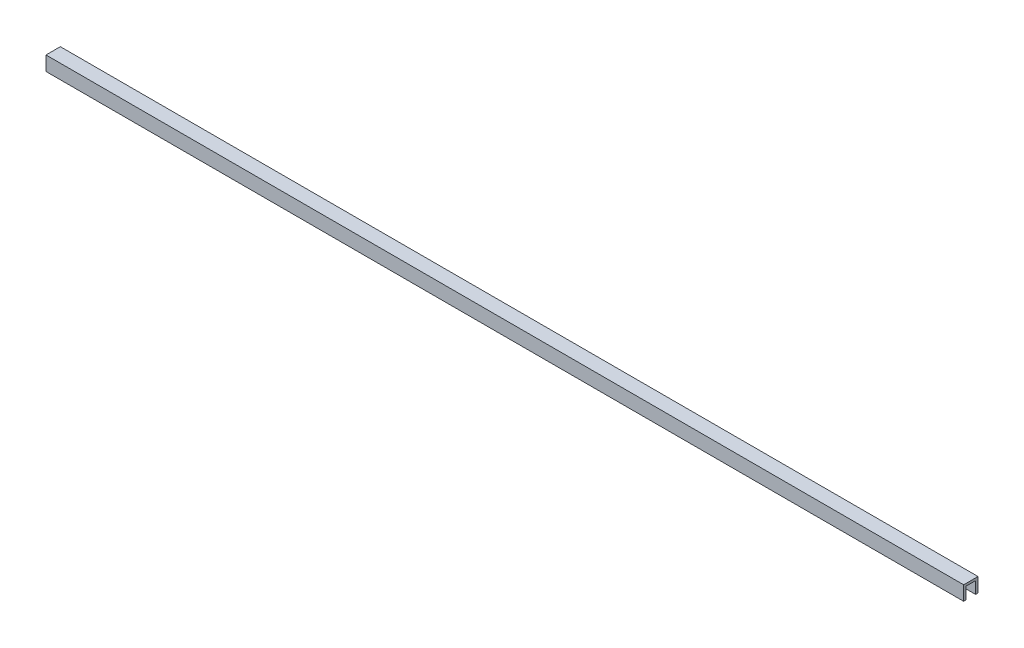
ISO-10303-21;
HEADER;
FILE_DESCRIPTION(('STEP AP214'),'2;1');
FILE_NAME('part.step','',(''),(''),'','','');
FILE_SCHEMA(('AUTOMOTIVE_DESIGN { 1 0 10303 214 1 1 1 1 }'));
ENDSEC;
DATA;
#1=APPLICATION_CONTEXT('core data for automotive mechanical design processes');
#2=APPLICATION_PROTOCOL_DEFINITION('international standard','automotive_design',2000,#1);
#3=PRODUCT_CONTEXT('',#1,'mechanical');
#4=PRODUCT('Part','Part','',(#3));
#5=PRODUCT_RELATED_PRODUCT_CATEGORY('part','',(#4));
#6=PRODUCT_DEFINITION_FORMATION('','',#4);
#7=PRODUCT_DEFINITION_CONTEXT('part definition',#1,'design');
#8=PRODUCT_DEFINITION('design','',#6,#7);
#9=PRODUCT_DEFINITION_SHAPE('','',#8);
#10=(LENGTH_UNIT() NAMED_UNIT(*) SI_UNIT(.MILLI.,.METRE.));
#11=(NAMED_UNIT(*) PLANE_ANGLE_UNIT() SI_UNIT($,.RADIAN.));
#12=(NAMED_UNIT(*) SI_UNIT($,.STERADIAN.) SOLID_ANGLE_UNIT());
#13=UNCERTAINTY_MEASURE_WITH_UNIT(LENGTH_MEASURE(1.E-05),#10,'distance_accuracy_value','');
#14=(GEOMETRIC_REPRESENTATION_CONTEXT(3) GLOBAL_UNCERTAINTY_ASSIGNED_CONTEXT((#13)) GLOBAL_UNIT_ASSIGNED_CONTEXT((#10,
#11,#12)) REPRESENTATION_CONTEXT('',''));
#15=CARTESIAN_POINT('',(0.,0.,0.));
#16=DIRECTION('',(0.,0.,1.));
#17=DIRECTION('',(1.,0.,0.));
#18=AXIS2_PLACEMENT_3D('',#15,#16,#17);
#19=CARTESIAN_POINT('',(-609.6,-9.525,6.35));
#20=DIRECTION('',(0.,0.,-1.));
#21=DIRECTION('',(-1.,0.,0.));
#22=AXIS2_PLACEMENT_3D('',#19,#20,#21);
#23=PLANE('',#22);
#24=DIRECTION('',(1.,0.,0.));
#25=VECTOR('',#24,1.);
#26=CARTESIAN_POINT('',(-609.6,-9.525,6.35));
#27=LINE('',#26,#25);
#28=CARTESIAN_POINT('',(-609.6,-9.525,6.35));
#29=VERTEX_POINT('',#28);
#30=CARTESIAN_POINT('',(609.6,-9.525,6.35));
#31=VERTEX_POINT('',#30);
#32=EDGE_CURVE('E84',#29,#31,#27,.T.);
#33=ORIENTED_EDGE('',*,*,#32,.F.);
#34=DIRECTION('',(0.,1.,0.));
#35=VECTOR('',#34,1.);
#36=CARTESIAN_POINT('',(-609.6,0.,6.35));
#37=LINE('',#36,#35);
#38=CARTESIAN_POINT('',(-609.6,6.35,6.35));
#39=VERTEX_POINT('',#38);
#40=EDGE_CURVE('E123',#29,#39,#37,.T.);
#41=ORIENTED_EDGE('',*,*,#40,.T.);
#42=DIRECTION('',(1.,0.,0.));
#43=VECTOR('',#42,1.);
#44=CARTESIAN_POINT('',(-609.6,6.35,6.35));
#45=LINE('',#44,#43);
#46=CARTESIAN_POINT('',(609.6,6.35,6.35));
#47=VERTEX_POINT('',#46);
#48=EDGE_CURVE('E20',#47,#39,#45,.F.);
#49=ORIENTED_EDGE('',*,*,#48,.F.);
#50=DIRECTION('',(0.,1.,0.));
#51=VECTOR('',#50,1.);
#52=CARTESIAN_POINT('',(609.6,0.,6.35));
#53=LINE('',#52,#51);
#54=EDGE_CURVE('E95',#31,#47,#53,.T.);
#55=ORIENTED_EDGE('',*,*,#54,.F.);
#56=EDGE_LOOP('',(#33,#41,#49,#55));
#57=FACE_BOUND('',#56,.T.);
#58=ADVANCED_FACE('F17',(#57),#23,.T.);
#59=CARTESIAN_POINT('',(-609.6,6.35,6.35));
#60=DIRECTION('',(0.,-1.,0.));
#61=DIRECTION('',(0.,0.,-1.));
#62=AXIS2_PLACEMENT_3D('',#59,#60,#61);
#63=PLANE('',#62);
#64=ORIENTED_EDGE('',*,*,#48,.T.);
#65=DIRECTION('',(0.,0.,-1.));
#66=VECTOR('',#65,1.);
#67=CARTESIAN_POINT('',(-609.6,6.35,0.));
#68=LINE('',#67,#66);
#69=CARTESIAN_POINT('',(-609.6,6.35,-6.35));
#70=VERTEX_POINT('',#69);
#71=EDGE_CURVE('E119',#39,#70,#68,.T.);
#72=ORIENTED_EDGE('',*,*,#71,.T.);
#73=DIRECTION('',(1.,0.,0.));
#74=VECTOR('',#73,1.);
#75=CARTESIAN_POINT('',(-609.6,6.35,-6.35));
#76=LINE('',#75,#74);
#77=CARTESIAN_POINT('',(609.6,6.35,-6.35));
#78=VERTEX_POINT('',#77);
#79=EDGE_CURVE('E111',#78,#70,#76,.F.);
#80=ORIENTED_EDGE('',*,*,#79,.F.);
#81=DIRECTION('',(0.,0.,-1.));
#82=VECTOR('',#81,1.);
#83=CARTESIAN_POINT('',(609.6,6.35,0.));
#84=LINE('',#83,#82);
#85=EDGE_CURVE('E98',#47,#78,#84,.T.);
#86=ORIENTED_EDGE('',*,*,#85,.F.);
#87=EDGE_LOOP('',(#64,#72,#80,#86));
#88=FACE_BOUND('',#87,.T.);
#89=ADVANCED_FACE('F118',(#88),#63,.T.);
#90=CARTESIAN_POINT('',(-609.6,6.35,-6.35));
#91=DIRECTION('',(0.,0.,1.));
#92=DIRECTION('',(1.,0.,0.));
#93=AXIS2_PLACEMENT_3D('',#90,#91,#92);
#94=PLANE('',#93);
#95=ORIENTED_EDGE('',*,*,#79,.T.);
#96=DIRECTION('',(0.,1.,0.));
#97=VECTOR('',#96,1.);
#98=CARTESIAN_POINT('',(-609.6,0.,-6.35));
#99=LINE('',#98,#97);
#100=CARTESIAN_POINT('',(-609.6,-9.525,-6.35));
#101=VERTEX_POINT('',#100);
#102=EDGE_CURVE('E125',#70,#101,#99,.F.);
#103=ORIENTED_EDGE('',*,*,#102,.T.);
#104=DIRECTION('',(1.,0.,0.));
#105=VECTOR('',#104,1.);
#106=CARTESIAN_POINT('',(-609.6,-9.525,-6.35));
#107=LINE('',#106,#105);
#108=CARTESIAN_POINT('',(609.6,-9.525,-6.35));
#109=VERTEX_POINT('',#108);
#110=EDGE_CURVE('E109',#109,#101,#107,.F.);
#111=ORIENTED_EDGE('',*,*,#110,.F.);
#112=DIRECTION('',(0.,1.,0.));
#113=VECTOR('',#112,1.);
#114=CARTESIAN_POINT('',(609.6,0.,-6.35));
#115=LINE('',#114,#113);
#116=EDGE_CURVE('E143',#78,#109,#115,.F.);
#117=ORIENTED_EDGE('',*,*,#116,.F.);
#118=EDGE_LOOP('',(#95,#103,#111,#117));
#119=FACE_BOUND('',#118,.T.);
#120=ADVANCED_FACE('F146',(#119),#94,.T.);
#121=CARTESIAN_POINT('',(-609.6,-9.525,-6.35));
#122=DIRECTION('',(0.,-1.,0.));
#123=DIRECTION('',(0.,0.,-1.));
#124=AXIS2_PLACEMENT_3D('',#121,#122,#123);
#125=PLANE('',#124);
#126=ORIENTED_EDGE('',*,*,#110,.T.);
#127=DIRECTION('',(0.,0.,-1.));
#128=VECTOR('',#127,1.);
#129=CARTESIAN_POINT('',(-609.6,-9.525,0.));
#130=LINE('',#129,#128);
#131=CARTESIAN_POINT('',(-609.6,-9.525,-9.525));
#132=VERTEX_POINT('',#131);
#133=EDGE_CURVE('E127',#101,#132,#130,.T.);
#134=ORIENTED_EDGE('',*,*,#133,.T.);
#135=DIRECTION('',(-1.,0.,0.));
#136=VECTOR('',#135,1.);
#137=CARTESIAN_POINT('',(-609.6,-9.525,-9.525));
#138=LINE('',#137,#136);
#139=CARTESIAN_POINT('',(609.6,-9.525,-9.525));
#140=VERTEX_POINT('',#139);
#141=EDGE_CURVE('E92',#140,#132,#138,.T.);
#142=ORIENTED_EDGE('',*,*,#141,.F.);
#143=DIRECTION('',(0.,0.,-1.));
#144=VECTOR('',#143,1.);
#145=CARTESIAN_POINT('',(609.6,-9.525,0.));
#146=LINE('',#145,#144);
#147=EDGE_CURVE('E140',#109,#140,#146,.T.);
#148=ORIENTED_EDGE('',*,*,#147,.F.);
#149=EDGE_LOOP('',(#126,#134,#142,#148));
#150=FACE_BOUND('',#149,.T.);
#151=ADVANCED_FACE('F148',(#150),#125,.T.);
#152=CARTESIAN_POINT('',(-609.6,-9.525,-9.525));
#153=DIRECTION('',(0.,0.,-1.));
#154=DIRECTION('',(-1.,0.,0.));
#155=AXIS2_PLACEMENT_3D('',#152,#153,#154);
#156=PLANE('',#155);
#157=ORIENTED_EDGE('',*,*,#141,.T.);
#158=DIRECTION('',(0.,1.,0.));
#159=VECTOR('',#158,1.);
#160=CARTESIAN_POINT('',(-609.6,0.,-9.525));
#161=LINE('',#160,#159);
#162=CARTESIAN_POINT('',(-609.6,9.525,-9.525));
#163=VERTEX_POINT('',#162);
#164=EDGE_CURVE('E163',#132,#163,#161,.T.);
#165=ORIENTED_EDGE('',*,*,#164,.T.);
#166=DIRECTION('',(1.,0.,0.));
#167=VECTOR('',#166,1.);
#168=CARTESIAN_POINT('',(-609.6,9.525,-9.525));
#169=LINE('',#168,#167);
#170=CARTESIAN_POINT('',(609.6,9.525,-9.525));
#171=VERTEX_POINT('',#170);
#172=EDGE_CURVE('E133',#171,#163,#169,.F.);
#173=ORIENTED_EDGE('',*,*,#172,.F.);
#174=DIRECTION('',(0.,1.,0.));
#175=VECTOR('',#174,1.);
#176=CARTESIAN_POINT('',(609.6,0.,-9.525));
#177=LINE('',#176,#175);
#178=EDGE_CURVE('E138',#140,#171,#177,.T.);
#179=ORIENTED_EDGE('',*,*,#178,.F.);
#180=EDGE_LOOP('',(#157,#165,#173,#179));
#181=FACE_BOUND('',#180,.T.);
#182=ADVANCED_FACE('F152',(#181),#156,.T.);
#183=CARTESIAN_POINT('',(-609.6,-9.525,9.525));
#184=DIRECTION('',(0.,-1.,0.));
#185=DIRECTION('',(0.,0.,-1.));
#186=AXIS2_PLACEMENT_3D('',#183,#184,#185);
#187=PLANE('',#186);
#188=DIRECTION('',(1.,0.,0.));
#189=VECTOR('',#188,1.);
#190=CARTESIAN_POINT('',(-609.6,-9.525,9.525));
#191=LINE('',#190,#189);
#192=CARTESIAN_POINT('',(-609.6,-9.525,9.525));
#193=VERTEX_POINT('',#192);
#194=CARTESIAN_POINT('',(609.6,-9.525,9.525));
#195=VERTEX_POINT('',#194);
#196=EDGE_CURVE('E158',#193,#195,#191,.T.);
#197=ORIENTED_EDGE('',*,*,#196,.F.);
#198=DIRECTION('',(0.,0.,-1.));
#199=VECTOR('',#198,1.);
#200=CARTESIAN_POINT('',(-609.6,-9.525,0.));
#201=LINE('',#200,#199);
#202=EDGE_CURVE('E90',#193,#29,#201,.T.);
#203=ORIENTED_EDGE('',*,*,#202,.T.);
#204=ORIENTED_EDGE('',*,*,#32,.T.);
#205=DIRECTION('',(0.,0.,-1.));
#206=VECTOR('',#205,1.);
#207=CARTESIAN_POINT('',(609.6,-9.525,0.));
#208=LINE('',#207,#206);
#209=EDGE_CURVE('E87',#195,#31,#208,.T.);
#210=ORIENTED_EDGE('',*,*,#209,.F.);
#211=EDGE_LOOP('',(#197,#203,#204,#210));
#212=FACE_BOUND('',#211,.T.);
#213=ADVANCED_FACE('F85',(#212),#187,.T.);
#214=CARTESIAN_POINT('',(609.6,0.,0.));
#215=DIRECTION('',(1.,0.,0.));
#216=DIRECTION('',(0.,0.,-1.));
#217=AXIS2_PLACEMENT_3D('',#214,#215,#216);
#218=PLANE('',#217);
#219=DIRECTION('',(0.,0.,1.));
#220=VECTOR('',#219,1.);
#221=CARTESIAN_POINT('',(609.6,9.525,-9.525));
#222=LINE('',#221,#220);
#223=CARTESIAN_POINT('',(609.6,9.525,9.525));
#224=VERTEX_POINT('',#223);
#225=EDGE_CURVE('E135',#224,#171,#222,.F.);
#226=ORIENTED_EDGE('',*,*,#225,.F.);
#227=DIRECTION('',(0.,1.,0.));
#228=VECTOR('',#227,1.);
#229=CARTESIAN_POINT('',(609.6,9.525,9.525));
#230=LINE('',#229,#228);
#231=EDGE_CURVE('E102',#195,#224,#230,.T.);
#232=ORIENTED_EDGE('',*,*,#231,.F.);
#233=ORIENTED_EDGE('',*,*,#209,.T.);
#234=ORIENTED_EDGE('',*,*,#54,.T.);
#235=ORIENTED_EDGE('',*,*,#85,.T.);
#236=ORIENTED_EDGE('',*,*,#116,.T.);
#237=ORIENTED_EDGE('',*,*,#147,.T.);
#238=ORIENTED_EDGE('',*,*,#178,.T.);
#239=EDGE_LOOP('',(#226,#232,#233,#234,#235,#236,#237,#238));
#240=FACE_BOUND('',#239,.T.);
#241=ADVANCED_FACE('F100',(#240),#218,.T.);
#242=CARTESIAN_POINT('',(-609.6,9.525,-9.525));
#243=DIRECTION('',(0.,1.,0.));
#244=DIRECTION('',(0.,0.,1.));
#245=AXIS2_PLACEMENT_3D('',#242,#243,#244);
#246=PLANE('',#245);
#247=ORIENTED_EDGE('',*,*,#172,.T.);
#248=DIRECTION('',(0.,0.,-1.));
#249=VECTOR('',#248,1.);
#250=CARTESIAN_POINT('',(-609.6,9.525,0.));
#251=LINE('',#250,#249);
#252=CARTESIAN_POINT('',(-609.6,9.525,9.525));
#253=VERTEX_POINT('',#252);
#254=EDGE_CURVE('E35',#163,#253,#251,.F.);
#255=ORIENTED_EDGE('',*,*,#254,.T.);
#256=DIRECTION('',(1.,0.,0.));
#257=VECTOR('',#256,1.);
#258=CARTESIAN_POINT('',(-609.6,9.525,9.525));
#259=LINE('',#258,#257);
#260=EDGE_CURVE('E26',#224,#253,#259,.F.);
#261=ORIENTED_EDGE('',*,*,#260,.F.);
#262=ORIENTED_EDGE('',*,*,#225,.T.);
#263=EDGE_LOOP('',(#247,#255,#261,#262));
#264=FACE_BOUND('',#263,.T.);
#265=ADVANCED_FACE('F154',(#264),#246,.T.);
#266=CARTESIAN_POINT('',(-609.6,0.,0.));
#267=DIRECTION('',(1.,0.,0.));
#268=DIRECTION('',(0.,0.,-1.));
#269=AXIS2_PLACEMENT_3D('',#266,#267,#268);
#270=PLANE('',#269);
#271=ORIENTED_EDGE('',*,*,#164,.F.);
#272=ORIENTED_EDGE('',*,*,#133,.F.);
#273=ORIENTED_EDGE('',*,*,#102,.F.);
#274=ORIENTED_EDGE('',*,*,#71,.F.);
#275=ORIENTED_EDGE('',*,*,#40,.F.);
#276=ORIENTED_EDGE('',*,*,#202,.F.);
#277=DIRECTION('',(0.,1.,0.));
#278=VECTOR('',#277,1.);
#279=CARTESIAN_POINT('',(-609.6,9.525,9.525));
#280=LINE('',#279,#278);
#281=EDGE_CURVE('E11',#253,#193,#280,.F.);
#282=ORIENTED_EDGE('',*,*,#281,.F.);
#283=ORIENTED_EDGE('',*,*,#254,.F.);
#284=EDGE_LOOP('',(#271,#272,#273,#274,#275,#276,#282,#283));
#285=FACE_BOUND('',#284,.T.);
#286=ADVANCED_FACE('F122',(#285),#270,.F.);
#287=CARTESIAN_POINT('',(-609.6,9.525,9.525));
#288=DIRECTION('',(0.,0.,1.));
#289=DIRECTION('',(1.,0.,0.));
#290=AXIS2_PLACEMENT_3D('',#287,#288,#289);
#291=PLANE('',#290);
#292=ORIENTED_EDGE('',*,*,#260,.T.);
#293=ORIENTED_EDGE('',*,*,#281,.T.);
#294=ORIENTED_EDGE('',*,*,#196,.T.);
#295=ORIENTED_EDGE('',*,*,#231,.T.);
#296=EDGE_LOOP('',(#292,#293,#294,#295));
#297=FACE_BOUND('',#296,.T.);
#298=ADVANCED_FACE('F157',(#297),#291,.T.);
#299=CLOSED_SHELL('',(#58,#89,#120,#151,#182,#213,#241,#265,#286,#298));
#300=MANIFOLD_SOLID_BREP('B1',#299);
#301=ADVANCED_BREP_SHAPE_REPRESENTATION('',(#18,#300),#14);
#302=SHAPE_DEFINITION_REPRESENTATION(#9,#301);
ENDSEC;
END-ISO-10303-21;
